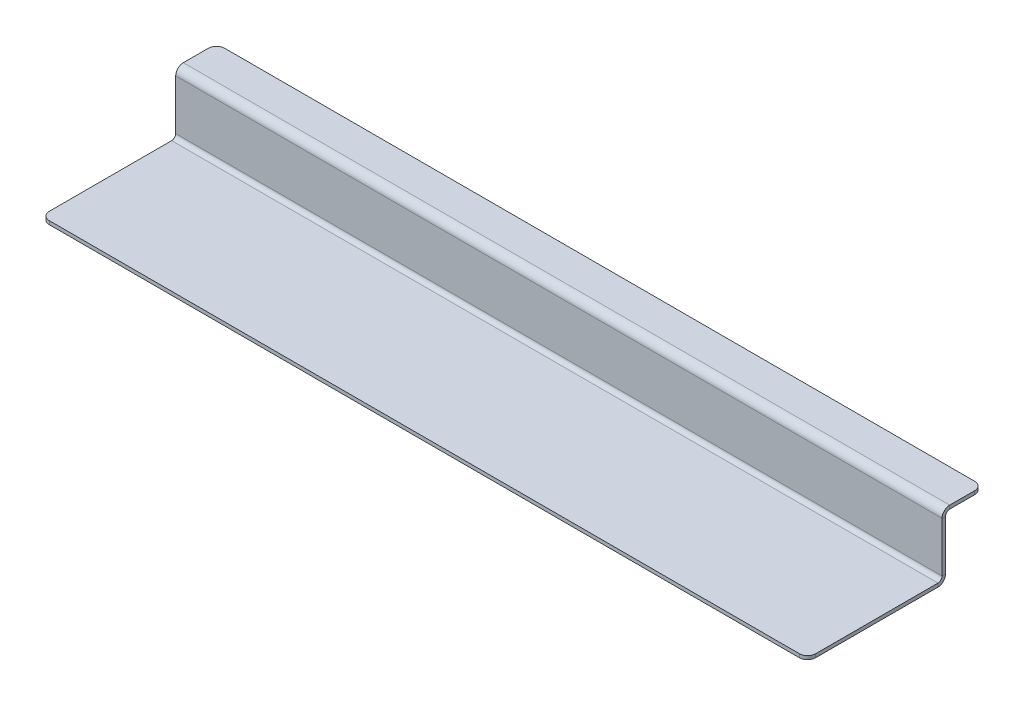
ISO-10303-21;
HEADER;
FILE_DESCRIPTION(('STEP AP214'),'2;1');
FILE_NAME('part.step','',(''),(''),'','','');
FILE_SCHEMA(('AUTOMOTIVE_DESIGN { 1 0 10303 214 1 1 1 1 }'));
ENDSEC;
DATA;
#1=APPLICATION_CONTEXT('core data for automotive mechanical design processes');
#2=APPLICATION_PROTOCOL_DEFINITION('international standard','automotive_design',2000,#1);
#3=PRODUCT_CONTEXT('',#1,'mechanical');
#4=PRODUCT('Part','Part','',(#3));
#5=PRODUCT_RELATED_PRODUCT_CATEGORY('part','',(#4));
#6=PRODUCT_DEFINITION_FORMATION('','',#4);
#7=PRODUCT_DEFINITION_CONTEXT('part definition',#1,'design');
#8=PRODUCT_DEFINITION('design','',#6,#7);
#9=PRODUCT_DEFINITION_SHAPE('','',#8);
#10=(LENGTH_UNIT() NAMED_UNIT(*) SI_UNIT(.MILLI.,.METRE.));
#11=(NAMED_UNIT(*) PLANE_ANGLE_UNIT() SI_UNIT($,.RADIAN.));
#12=(NAMED_UNIT(*) SI_UNIT($,.STERADIAN.) SOLID_ANGLE_UNIT());
#13=UNCERTAINTY_MEASURE_WITH_UNIT(LENGTH_MEASURE(1.E-05),#10,'distance_accuracy_value','');
#14=(GEOMETRIC_REPRESENTATION_CONTEXT(3) GLOBAL_UNCERTAINTY_ASSIGNED_CONTEXT((#13)) GLOBAL_UNIT_ASSIGNED_CONTEXT((#10,
#11,#12)) REPRESENTATION_CONTEXT('',''));
#15=CARTESIAN_POINT('',(0.,0.,0.));
#16=DIRECTION('',(0.,0.,1.));
#17=DIRECTION('',(1.,0.,0.));
#18=AXIS2_PLACEMENT_3D('',#15,#16,#17);
#19=CARTESIAN_POINT('',(596.9,-50.8,31.7500000000002));
#20=DIRECTION('',(-1.,0.,0.));
#21=DIRECTION('',(0.,0.,-1.));
#22=AXIS2_PLACEMENT_3D('',#19,#20,#21);
#23=PLANE('',#22);
#24=DIRECTION('',(0.,0.,-1.));
#25=VECTOR('',#24,1.);
#26=CARTESIAN_POINT('',(596.9,-44.87164,31.7500000000001));
#27=LINE('',#26,#25);
#28=CARTESIAN_POINT('',(596.9,-44.87164,31.7500000000001));
#29=VERTEX_POINT('',#28);
#30=CARTESIAN_POINT('',(596.9,-44.87164,28.9966400000001));
#31=VERTEX_POINT('',#30);
#32=EDGE_CURVE('E204',#29,#31,#27,.T.);
#33=ORIENTED_EDGE('',*,*,#32,.T.);
#34=DIRECTION('',(0.,1.,0.));
#35=VECTOR('',#34,1.);
#36=CARTESIAN_POINT('',(596.9,-50.8,28.9966400000002));
#37=LINE('',#36,#35);
#38=CARTESIAN_POINT('',(596.9,-5.92836000000005,28.99664));
#39=VERTEX_POINT('',#38);
#40=EDGE_CURVE('E219',#39,#31,#37,.F.);
#41=ORIENTED_EDGE('',*,*,#40,.F.);
#42=DIRECTION('',(0.,0.,-1.));
#43=VECTOR('',#42,1.);
#44=CARTESIAN_POINT('',(596.9,-5.92836000000001,28.99664));
#45=LINE('',#44,#43);
#46=CARTESIAN_POINT('',(596.9,-5.92835999999999,31.75));
#47=VERTEX_POINT('',#46);
#48=EDGE_CURVE('E225',#39,#47,#45,.F.);
#49=ORIENTED_EDGE('',*,*,#48,.T.);
#50=DIRECTION('',(0.,-1.,0.));
#51=VECTOR('',#50,1.);
#52=CARTESIAN_POINT('',(596.9,1.19661315799875E-13,31.75));
#53=LINE('',#52,#51);
#54=EDGE_CURVE('E213',#47,#29,#53,.T.);
#55=ORIENTED_EDGE('',*,*,#54,.T.);
#56=EDGE_LOOP('',(#33,#41,#49,#55));
#57=FACE_BOUND('',#56,.T.);
#58=ADVANCED_FACE('F43',(#57),#23,.F.);
#59=CARTESIAN_POINT('',(0.,-2.75335999999999,31.75));
#60=DIRECTION('',(1.,0.,0.));
#61=DIRECTION('',(0.,0.,1.));
#62=AXIS2_PLACEMENT_3D('',#59,#60,#61);
#63=PLANE('',#62);
#64=DIRECTION('',(0.,0.,-1.));
#65=VECTOR('',#64,1.);
#66=CARTESIAN_POINT('',(0.,-44.87164,31.7500000000001));
#67=LINE('',#66,#65);
#68=CARTESIAN_POINT('',(0.,-44.87164,31.7500000000001));
#69=VERTEX_POINT('',#68);
#70=CARTESIAN_POINT('',(0.,-44.87164,28.9966400000001));
#71=VERTEX_POINT('',#70);
#72=EDGE_CURVE('E190',#69,#71,#67,.T.);
#73=ORIENTED_EDGE('',*,*,#72,.F.);
#74=DIRECTION('',(0.,1.,0.));
#75=VECTOR('',#74,1.);
#76=CARTESIAN_POINT('',(0.,1.19661315799875E-13,31.75));
#77=LINE('',#76,#75);
#78=CARTESIAN_POINT('',(0.,-5.92835999999996,31.75));
#79=VERTEX_POINT('',#78);
#80=EDGE_CURVE('E209',#69,#79,#77,.T.);
#81=ORIENTED_EDGE('',*,*,#80,.T.);
#82=DIRECTION('',(0.,0.,-1.));
#83=VECTOR('',#82,1.);
#84=CARTESIAN_POINT('',(0.,-5.92835999999997,31.75));
#85=LINE('',#84,#83);
#86=CARTESIAN_POINT('',(0.,-5.92835999999997,28.99664));
#87=VERTEX_POINT('',#86);
#88=EDGE_CURVE('E207',#87,#79,#85,.F.);
#89=ORIENTED_EDGE('',*,*,#88,.F.);
#90=DIRECTION('',(0.,-1.,0.));
#91=VECTOR('',#90,1.);
#92=CARTESIAN_POINT('',(0.,-2.75336,28.99664));
#93=LINE('',#92,#91);
#94=EDGE_CURVE('E216',#71,#87,#93,.F.);
#95=ORIENTED_EDGE('',*,*,#94,.F.);
#96=EDGE_LOOP('',(#73,#81,#89,#95));
#97=FACE_BOUND('',#96,.T.);
#98=ADVANCED_FACE('F340',(#97),#63,.F.);
#99=CARTESIAN_POINT('',(0.,1.19661315799875E-13,31.75));
#100=DIRECTION('',(0.,0.,-1.));
#101=DIRECTION('',(0.,-1.,0.));
#102=AXIS2_PLACEMENT_3D('',#99,#100,#101);
#103=PLANE('',#102);
#104=DIRECTION('',(-1.,0.,0.));
#105=VECTOR('',#104,1.);
#106=CARTESIAN_POINT('',(0.,-44.87164,31.7500000000001));
#107=LINE('',#106,#105);
#108=EDGE_CURVE('E196',#69,#29,#107,.F.);
#109=ORIENTED_EDGE('',*,*,#108,.T.);
#110=ORIENTED_EDGE('',*,*,#54,.F.);
#111=DIRECTION('',(1.,0.,0.));
#112=VECTOR('',#111,1.);
#113=CARTESIAN_POINT('',(0.,-5.92835999999997,31.75));
#114=LINE('',#113,#112);
#115=EDGE_CURVE('E222',#47,#79,#114,.F.);
#116=ORIENTED_EDGE('',*,*,#115,.T.);
#117=ORIENTED_EDGE('',*,*,#80,.F.);
#118=EDGE_LOOP('',(#109,#110,#116,#117));
#119=FACE_BOUND('',#118,.T.);
#120=ADVANCED_FACE('F335',(#119),#103,.F.);
#121=CARTESIAN_POINT('',(0.,1.10048010740757E-13,28.99664));
#122=DIRECTION('',(0.,0.,-1.));
#123=DIRECTION('',(0.,-1.,0.));
#124=AXIS2_PLACEMENT_3D('',#121,#122,#123);
#125=PLANE('',#124);
#126=ORIENTED_EDGE('',*,*,#94,.T.);
#127=DIRECTION('',(1.,0.,0.));
#128=VECTOR('',#127,1.);
#129=CARTESIAN_POINT('',(0.,-5.92835999999999,28.99664));
#130=LINE('',#129,#128);
#131=EDGE_CURVE('E228',#87,#39,#130,.T.);
#132=ORIENTED_EDGE('',*,*,#131,.T.);
#133=ORIENTED_EDGE('',*,*,#40,.T.);
#134=DIRECTION('',(-1.,0.,0.));
#135=VECTOR('',#134,1.);
#136=CARTESIAN_POINT('',(0.,-44.87164,28.9966400000001));
#137=LINE('',#136,#135);
#138=EDGE_CURVE('E191',#71,#31,#137,.F.);
#139=ORIENTED_EDGE('',*,*,#138,.F.);
#140=EDGE_LOOP('',(#126,#132,#133,#139));
#141=FACE_BOUND('',#140,.T.);
#142=ADVANCED_FACE('F342',(#141),#125,.T.);
#143=CARTESIAN_POINT('',(596.9,-2.75336,0.));
#144=DIRECTION('',(1.,0.,0.));
#145=DIRECTION('',(0.,0.,1.));
#146=AXIS2_PLACEMENT_3D('',#143,#144,#145);
#147=PLANE('',#146);
#148=DIRECTION('',(0.,0.,1.));
#149=VECTOR('',#148,1.);
#150=CARTESIAN_POINT('',(596.9,0.,0.));
#151=LINE('',#150,#149);
#152=CARTESIAN_POINT('',(596.9,0.,6.35));
#153=VERTEX_POINT('',#152);
#154=CARTESIAN_POINT('',(596.9,0.,25.82164));
#155=VERTEX_POINT('',#154);
#156=EDGE_CURVE('E257',#153,#155,#151,.T.);
#157=ORIENTED_EDGE('',*,*,#156,.T.);
#158=DIRECTION('',(0.,1.,0.));
#159=VECTOR('',#158,1.);
#160=CARTESIAN_POINT('',(596.9,-2.75336000000006,25.82164));
#161=LINE('',#160,#159);
#162=CARTESIAN_POINT('',(596.9,-2.75336,25.82164));
#163=VERTEX_POINT('',#162);
#164=EDGE_CURVE('E239',#163,#155,#161,.T.);
#165=ORIENTED_EDGE('',*,*,#164,.F.);
#166=DIRECTION('',(0.,0.,1.));
#167=VECTOR('',#166,1.);
#168=CARTESIAN_POINT('',(596.9,-2.75336,0.));
#169=LINE('',#168,#167);
#170=CARTESIAN_POINT('',(596.9,-2.75336,6.35));
#171=VERTEX_POINT('',#170);
#172=EDGE_CURVE('E260',#171,#163,#169,.T.);
#173=ORIENTED_EDGE('',*,*,#172,.F.);
#174=DIRECTION('',(0.,1.,0.));
#175=VECTOR('',#174,1.);
#176=CARTESIAN_POINT('',(596.9,-2.75336,6.35));
#177=LINE('',#176,#175);
#178=EDGE_CURVE('E279',#153,#171,#177,.F.);
#179=ORIENTED_EDGE('',*,*,#178,.F.);
#180=EDGE_LOOP('',(#157,#165,#173,#179));
#181=FACE_BOUND('',#180,.T.);
#182=ADVANCED_FACE('F386',(#181),#147,.T.);
#183=CARTESIAN_POINT('',(0.,-2.75336,0.));
#184=DIRECTION('',(0.,-1.,0.));
#185=DIRECTION('',(0.,0.,1.));
#186=AXIS2_PLACEMENT_3D('',#183,#184,#185);
#187=PLANE('',#186);
#188=ORIENTED_EDGE('',*,*,#172,.T.);
#189=DIRECTION('',(1.,0.,0.));
#190=VECTOR('',#189,1.);
#191=CARTESIAN_POINT('',(596.9,-2.75336000000006,25.82164));
#192=LINE('',#191,#190);
#193=CARTESIAN_POINT('',(0.,-2.75336,25.82164));
#194=VERTEX_POINT('',#193);
#195=EDGE_CURVE('E243',#163,#194,#192,.F.);
#196=ORIENTED_EDGE('',*,*,#195,.T.);
#197=DIRECTION('',(0.,0.,-1.));
#198=VECTOR('',#197,1.);
#199=CARTESIAN_POINT('',(0.,-2.75336,0.));
#200=LINE('',#199,#198);
#201=CARTESIAN_POINT('',(0.,-2.75336,6.35));
#202=VERTEX_POINT('',#201);
#203=EDGE_CURVE('E253',#194,#202,#200,.T.);
#204=ORIENTED_EDGE('',*,*,#203,.T.);
#205=CARTESIAN_POINT('',(6.35,-2.75336,6.35));
#206=DIRECTION('',(0.,1.,0.));
#207=DIRECTION('',(0.,0.,1.));
#208=AXIS2_PLACEMENT_3D('',#205,#206,#207);
#209=CIRCLE('',#208,6.35);
#210=CARTESIAN_POINT('',(6.35,-2.75336,0.));
#211=VERTEX_POINT('',#210);
#212=EDGE_CURVE('E282',#211,#202,#209,.T.);
#213=ORIENTED_EDGE('',*,*,#212,.F.);
#214=DIRECTION('',(1.,0.,0.));
#215=VECTOR('',#214,1.);
#216=CARTESIAN_POINT('',(0.,-2.75336,0.));
#217=LINE('',#216,#215);
#218=CARTESIAN_POINT('',(590.55,-2.75336,0.));
#219=VERTEX_POINT('',#218);
#220=EDGE_CURVE('E256',#211,#219,#217,.T.);
#221=ORIENTED_EDGE('',*,*,#220,.T.);
#222=CARTESIAN_POINT('',(590.55,-2.75336,6.35));
#223=DIRECTION('',(0.,1.,0.));
#224=DIRECTION('',(0.,0.,1.));
#225=AXIS2_PLACEMENT_3D('',#222,#223,#224);
#226=CIRCLE('',#225,6.35);
#227=EDGE_CURVE('E285',#171,#219,#226,.T.);
#228=ORIENTED_EDGE('',*,*,#227,.F.);
#229=EDGE_LOOP('',(#188,#196,#204,#213,#221,#228));
#230=FACE_BOUND('',#229,.T.);
#231=ADVANCED_FACE('F364',(#230),#187,.T.);
#232=CARTESIAN_POINT('',(0.,0.,0.));
#233=DIRECTION('',(0.,-1.,0.));
#234=DIRECTION('',(0.,0.,1.));
#235=AXIS2_PLACEMENT_3D('',#232,#233,#234);
#236=PLANE('',#235);
#237=DIRECTION('',(1.,0.,0.));
#238=VECTOR('',#237,1.);
#239=CARTESIAN_POINT('',(0.,0.,0.));
#240=LINE('',#239,#238);
#241=CARTESIAN_POINT('',(6.35,0.,0.));
#242=VERTEX_POINT('',#241);
#243=CARTESIAN_POINT('',(590.55,0.,0.));
#244=VERTEX_POINT('',#243);
#245=EDGE_CURVE('E266',#242,#244,#240,.T.);
#246=ORIENTED_EDGE('',*,*,#245,.F.);
#247=CARTESIAN_POINT('',(6.35,0.,6.35));
#248=DIRECTION('',(0.,1.,0.));
#249=DIRECTION('',(0.,0.,1.));
#250=AXIS2_PLACEMENT_3D('',#247,#248,#249);
#251=CIRCLE('',#250,6.35);
#252=CARTESIAN_POINT('',(0.,0.,6.35));
#253=VERTEX_POINT('',#252);
#254=EDGE_CURVE('E274',#253,#242,#251,.F.);
#255=ORIENTED_EDGE('',*,*,#254,.F.);
#256=DIRECTION('',(0.,0.,-1.));
#257=VECTOR('',#256,1.);
#258=CARTESIAN_POINT('',(0.,0.,0.));
#259=LINE('',#258,#257);
#260=CARTESIAN_POINT('',(0.,0.,25.82164));
#261=VERTEX_POINT('',#260);
#262=EDGE_CURVE('E250',#261,#253,#259,.T.);
#263=ORIENTED_EDGE('',*,*,#262,.F.);
#264=DIRECTION('',(1.,0.,0.));
#265=VECTOR('',#264,1.);
#266=CARTESIAN_POINT('',(596.9,0.,25.82164));
#267=LINE('',#266,#265);
#268=EDGE_CURVE('E233',#155,#261,#267,.F.);
#269=ORIENTED_EDGE('',*,*,#268,.F.);
#270=ORIENTED_EDGE('',*,*,#156,.F.);
#271=CARTESIAN_POINT('',(590.55,0.,6.35));
#272=DIRECTION('',(0.,1.,0.));
#273=DIRECTION('',(0.,0.,1.));
#274=AXIS2_PLACEMENT_3D('',#271,#272,#273);
#275=CIRCLE('',#274,6.35);
#276=EDGE_CURVE('E277',#244,#153,#275,.F.);
#277=ORIENTED_EDGE('',*,*,#276,.F.);
#278=EDGE_LOOP('',(#246,#255,#263,#269,#270,#277));
#279=FACE_BOUND('',#278,.T.);
#280=ADVANCED_FACE('F458',(#279),#236,.F.);
#281=CARTESIAN_POINT('',(0.,-2.75336,0.));
#282=DIRECTION('',(-1.,0.,0.));
#283=DIRECTION('',(0.,0.,-1.));
#284=AXIS2_PLACEMENT_3D('',#281,#282,#283);
#285=PLANE('',#284);
#286=ORIENTED_EDGE('',*,*,#203,.F.);
#287=DIRECTION('',(0.,1.,0.));
#288=VECTOR('',#287,1.);
#289=CARTESIAN_POINT('',(0.,-2.75335999999998,25.82164));
#290=LINE('',#289,#288);
#291=EDGE_CURVE('E247',#194,#261,#290,.T.);
#292=ORIENTED_EDGE('',*,*,#291,.T.);
#293=ORIENTED_EDGE('',*,*,#262,.T.);
#294=DIRECTION('',(0.,1.,0.));
#295=VECTOR('',#294,1.);
#296=CARTESIAN_POINT('',(0.,-2.75336,6.35));
#297=LINE('',#296,#295);
#298=EDGE_CURVE('E11',#202,#253,#297,.T.);
#299=ORIENTED_EDGE('',*,*,#298,.F.);
#300=EDGE_LOOP('',(#286,#292,#293,#299));
#301=FACE_BOUND('',#300,.T.);
#302=ADVANCED_FACE('F360',(#301),#285,.T.);
#303=CARTESIAN_POINT('',(0.,-2.75336,0.));
#304=DIRECTION('',(0.,0.,-1.));
#305=DIRECTION('',(1.,0.,0.));
#306=AXIS2_PLACEMENT_3D('',#303,#304,#305);
#307=PLANE('',#306);
#308=ORIENTED_EDGE('',*,*,#220,.F.);
#309=DIRECTION('',(0.,1.,0.));
#310=VECTOR('',#309,1.);
#311=CARTESIAN_POINT('',(6.35,-2.75336,0.));
#312=LINE('',#311,#310);
#313=EDGE_CURVE('E263',#242,#211,#312,.F.);
#314=ORIENTED_EDGE('',*,*,#313,.F.);
#315=ORIENTED_EDGE('',*,*,#245,.T.);
#316=DIRECTION('',(0.,1.,0.));
#317=VECTOR('',#316,1.);
#318=CARTESIAN_POINT('',(590.55,-2.75336,0.));
#319=LINE('',#318,#317);
#320=EDGE_CURVE('E272',#219,#244,#319,.T.);
#321=ORIENTED_EDGE('',*,*,#320,.F.);
#322=EDGE_LOOP('',(#308,#314,#315,#321));
#323=FACE_BOUND('',#322,.T.);
#324=ADVANCED_FACE('F457',(#323),#307,.T.);
#325=CARTESIAN_POINT('',(0.,-5.92835999999998,25.82164));
#326=DIRECTION('',(-1.,0.,0.));
#327=DIRECTION('',(0.,-1.,0.));
#328=AXIS2_PLACEMENT_3D('',#325,#326,#327);
#329=PLANE('',#328);
#330=ORIENTED_EDGE('',*,*,#88,.T.);
#331=CARTESIAN_POINT('',(0.,-5.92835999999998,25.82164));
#332=DIRECTION('',(-1.,0.,0.));
#333=DIRECTION('',(0.,1.,0.));
#334=AXIS2_PLACEMENT_3D('',#331,#332,#333);
#335=CIRCLE('',#334,5.92836);
#336=EDGE_CURVE('E236',#261,#79,#335,.F.);
#337=ORIENTED_EDGE('',*,*,#336,.F.);
#338=ORIENTED_EDGE('',*,*,#291,.F.);
#339=CARTESIAN_POINT('',(0.,-5.92835999999998,25.82164));
#340=DIRECTION('',(-1.,0.,0.));
#341=DIRECTION('',(0.,1.,0.));
#342=AXIS2_PLACEMENT_3D('',#339,#340,#341);
#343=CIRCLE('',#342,3.175);
#344=EDGE_CURVE('E241',#194,#87,#343,.F.);
#345=ORIENTED_EDGE('',*,*,#344,.T.);
#346=EDGE_LOOP('',(#330,#337,#338,#345));
#347=FACE_BOUND('',#346,.T.);
#348=ADVANCED_FACE('F357',(#347),#329,.T.);
#349=CARTESIAN_POINT('',(596.9,-5.92836000000006,25.82164));
#350=DIRECTION('',(-1.,0.,0.));
#351=DIRECTION('',(0.,-1.,0.));
#352=AXIS2_PLACEMENT_3D('',#349,#350,#351);
#353=PLANE('',#352);
#354=CARTESIAN_POINT('',(596.9,-5.92836000000006,25.82164));
#355=DIRECTION('',(-1.,0.,0.));
#356=DIRECTION('',(0.,1.,0.));
#357=AXIS2_PLACEMENT_3D('',#354,#355,#356);
#358=CIRCLE('',#357,3.175);
#359=EDGE_CURVE('E212',#39,#163,#358,.T.);
#360=ORIENTED_EDGE('',*,*,#359,.T.);
#361=ORIENTED_EDGE('',*,*,#164,.T.);
#362=CARTESIAN_POINT('',(596.9,-5.92836000000006,25.82164));
#363=DIRECTION('',(-1.,0.,0.));
#364=DIRECTION('',(0.,1.,0.));
#365=AXIS2_PLACEMENT_3D('',#362,#363,#364);
#366=CIRCLE('',#365,5.92836);
#367=EDGE_CURVE('E237',#47,#155,#366,.T.);
#368=ORIENTED_EDGE('',*,*,#367,.F.);
#369=ORIENTED_EDGE('',*,*,#48,.F.);
#370=EDGE_LOOP('',(#360,#361,#368,#369));
#371=FACE_BOUND('',#370,.T.);
#372=ADVANCED_FACE('F348',(#371),#353,.F.);
#373=CARTESIAN_POINT('',(596.9,-5.92836000000006,25.82164));
#374=DIRECTION('',(1.,0.,0.));
#375=DIRECTION('',(0.,0.,1.));
#376=AXIS2_PLACEMENT_3D('',#373,#374,#375);
#377=CYLINDRICAL_SURFACE('',#376,5.92836);
#378=ORIENTED_EDGE('',*,*,#268,.T.);
#379=ORIENTED_EDGE('',*,*,#336,.T.);
#380=ORIENTED_EDGE('',*,*,#115,.F.);
#381=ORIENTED_EDGE('',*,*,#367,.T.);
#382=EDGE_LOOP('',(#378,#379,#380,#381));
#383=FACE_BOUND('',#382,.T.);
#384=ADVANCED_FACE('F353',(#383),#377,.T.);
#385=CARTESIAN_POINT('',(596.9,-5.92836000000006,25.82164));
#386=DIRECTION('',(1.,0.,0.));
#387=DIRECTION('',(0.,0.,1.));
#388=AXIS2_PLACEMENT_3D('',#385,#386,#387);
#389=CYLINDRICAL_SURFACE('',#388,3.175);
#390=ORIENTED_EDGE('',*,*,#195,.F.);
#391=ORIENTED_EDGE('',*,*,#359,.F.);
#392=ORIENTED_EDGE('',*,*,#131,.F.);
#393=ORIENTED_EDGE('',*,*,#344,.F.);
#394=EDGE_LOOP('',(#390,#391,#392,#393));
#395=FACE_BOUND('',#394,.T.);
#396=ADVANCED_FACE('F367',(#395),#389,.F.);
#397=CARTESIAN_POINT('',(596.9,-44.87164,34.9250000000002));
#398=DIRECTION('',(1.,0.,0.));
#399=DIRECTION('',(0.,0.,1.));
#400=AXIS2_PLACEMENT_3D('',#397,#398,#399);
#401=PLANE('',#400);
#402=DIRECTION('',(0.,1.,0.));
#403=VECTOR('',#402,1.);
#404=CARTESIAN_POINT('',(596.9,-50.8,34.9250000000002));
#405=LINE('',#404,#403);
#406=CARTESIAN_POINT('',(596.9,-48.04664,34.9250000000002));
#407=VERTEX_POINT('',#406);
#408=CARTESIAN_POINT('',(596.9,-50.8,34.9250000000002));
#409=VERTEX_POINT('',#408);
#410=EDGE_CURVE('E314',#407,#409,#405,.F.);
#411=ORIENTED_EDGE('',*,*,#410,.T.);
#412=CARTESIAN_POINT('',(596.9,-44.87164,34.9250000000002));
#413=DIRECTION('',(1.,0.,0.));
#414=DIRECTION('',(0.,0.,-1.));
#415=AXIS2_PLACEMENT_3D('',#412,#413,#414);
#416=CIRCLE('',#415,5.92836);
#417=EDGE_CURVE('E173',#31,#409,#416,.F.);
#418=ORIENTED_EDGE('',*,*,#417,.F.);
#419=ORIENTED_EDGE('',*,*,#32,.F.);
#420=CARTESIAN_POINT('',(596.9,-44.87164,34.9250000000002));
#421=DIRECTION('',(1.,0.,0.));
#422=DIRECTION('',(0.,0.,-1.));
#423=AXIS2_PLACEMENT_3D('',#420,#421,#422);
#424=CIRCLE('',#423,3.175);
#425=EDGE_CURVE('E192',#29,#407,#424,.F.);
#426=ORIENTED_EDGE('',*,*,#425,.T.);
#427=EDGE_LOOP('',(#411,#418,#419,#426));
#428=FACE_BOUND('',#427,.T.);
#429=ADVANCED_FACE('F317',(#428),#401,.T.);
#430=CARTESIAN_POINT('',(0.,-44.87164,34.9250000000002));
#431=DIRECTION('',(1.,0.,0.));
#432=DIRECTION('',(0.,0.,1.));
#433=AXIS2_PLACEMENT_3D('',#430,#431,#432);
#434=PLANE('',#433);
#435=CARTESIAN_POINT('',(0.,-44.87164,34.9250000000002));
#436=DIRECTION('',(1.,0.,0.));
#437=DIRECTION('',(0.,0.,-1.));
#438=AXIS2_PLACEMENT_3D('',#435,#436,#437);
#439=CIRCLE('',#438,3.175);
#440=CARTESIAN_POINT('',(0.,-48.04664,34.9250000000002));
#441=VERTEX_POINT('',#440);
#442=EDGE_CURVE('E202',#441,#69,#439,.T.);
#443=ORIENTED_EDGE('',*,*,#442,.T.);
#444=ORIENTED_EDGE('',*,*,#72,.T.);
#445=CARTESIAN_POINT('',(0.,-44.87164,34.9250000000002));
#446=DIRECTION('',(1.,0.,0.));
#447=DIRECTION('',(0.,0.,-1.));
#448=AXIS2_PLACEMENT_3D('',#445,#446,#447);
#449=CIRCLE('',#448,5.92836);
#450=CARTESIAN_POINT('',(0.,-50.8,34.9250000000001));
#451=VERTEX_POINT('',#450);
#452=EDGE_CURVE('E171',#451,#71,#449,.T.);
#453=ORIENTED_EDGE('',*,*,#452,.F.);
#454=DIRECTION('',(0.,1.,0.));
#455=VECTOR('',#454,1.);
#456=CARTESIAN_POINT('',(0.,-48.04664,34.9250000000001));
#457=LINE('',#456,#455);
#458=EDGE_CURVE('E176',#441,#451,#457,.F.);
#459=ORIENTED_EDGE('',*,*,#458,.F.);
#460=EDGE_LOOP('',(#443,#444,#453,#459));
#461=FACE_BOUND('',#460,.T.);
#462=ADVANCED_FACE('F188',(#461),#434,.F.);
#463=CARTESIAN_POINT('',(0.,-44.87164,34.9250000000002));
#464=DIRECTION('',(-1.,0.,0.));
#465=DIRECTION('',(0.,-1.,0.));
#466=AXIS2_PLACEMENT_3D('',#463,#464,#465);
#467=CYLINDRICAL_SURFACE('',#466,5.92836);
#468=ORIENTED_EDGE('',*,*,#138,.T.);
#469=ORIENTED_EDGE('',*,*,#417,.T.);
#470=DIRECTION('',(-1.,0.,0.));
#471=VECTOR('',#470,1.);
#472=CARTESIAN_POINT('',(596.9,-50.8,34.9250000000002));
#473=LINE('',#472,#471);
#474=EDGE_CURVE('E159',#451,#409,#473,.F.);
#475=ORIENTED_EDGE('',*,*,#474,.F.);
#476=ORIENTED_EDGE('',*,*,#452,.T.);
#477=EDGE_LOOP('',(#468,#469,#475,#476));
#478=FACE_BOUND('',#477,.T.);
#479=ADVANCED_FACE('F169',(#478),#467,.T.);
#480=CARTESIAN_POINT('',(0.,-44.87164,34.9250000000002));
#481=DIRECTION('',(-1.,0.,0.));
#482=DIRECTION('',(0.,-1.,0.));
#483=AXIS2_PLACEMENT_3D('',#480,#481,#482);
#484=CYLINDRICAL_SURFACE('',#483,3.175);
#485=ORIENTED_EDGE('',*,*,#108,.F.);
#486=ORIENTED_EDGE('',*,*,#442,.F.);
#487=DIRECTION('',(-1.,0.,0.));
#488=VECTOR('',#487,1.);
#489=CARTESIAN_POINT('',(596.9,-48.04664,34.9250000000002));
#490=LINE('',#489,#488);
#491=EDGE_CURVE('E185',#407,#441,#490,.T.);
#492=ORIENTED_EDGE('',*,*,#491,.F.);
#493=ORIENTED_EDGE('',*,*,#425,.F.);
#494=EDGE_LOOP('',(#485,#486,#492,#493));
#495=FACE_BOUND('',#494,.T.);
#496=ADVANCED_FACE('F331',(#495),#484,.F.);
#497=CARTESIAN_POINT('',(596.9,-50.8,31.7500000000002));
#498=DIRECTION('',(-1.,0.,0.));
#499=DIRECTION('',(0.,0.,-1.));
#500=AXIS2_PLACEMENT_3D('',#497,#498,#499);
#501=PLANE('',#500);
#502=DIRECTION('',(0.,0.,-1.));
#503=VECTOR('',#502,1.);
#504=CARTESIAN_POINT('',(596.9,-50.8,0.));
#505=LINE('',#504,#503);
#506=CARTESIAN_POINT('',(596.9,-50.8,130.175));
#507=VERTEX_POINT('',#506);
#508=EDGE_CURVE('E165',#507,#409,#505,.T.);
#509=ORIENTED_EDGE('',*,*,#508,.T.);
#510=ORIENTED_EDGE('',*,*,#410,.F.);
#511=DIRECTION('',(0.,0.,1.));
#512=VECTOR('',#511,1.);
#513=CARTESIAN_POINT('',(596.9,-48.04664,31.7500000000002));
#514=LINE('',#513,#512);
#515=CARTESIAN_POINT('',(596.9,-48.04664,130.175));
#516=VERTEX_POINT('',#515);
#517=EDGE_CURVE('E175',#516,#407,#514,.F.);
#518=ORIENTED_EDGE('',*,*,#517,.F.);
#519=DIRECTION('',(0.,1.,0.));
#520=VECTOR('',#519,1.);
#521=CARTESIAN_POINT('',(596.9,-50.8,130.175));
#522=LINE('',#521,#520);
#523=EDGE_CURVE('E288',#507,#516,#522,.T.);
#524=ORIENTED_EDGE('',*,*,#523,.F.);
#525=EDGE_LOOP('',(#509,#510,#518,#524));
#526=FACE_BOUND('',#525,.T.);
#527=ADVANCED_FACE('F321',(#526),#501,.F.);
#528=CARTESIAN_POINT('',(0.,-50.8,136.525));
#529=DIRECTION('',(1.,0.,0.));
#530=DIRECTION('',(0.,0.,1.));
#531=AXIS2_PLACEMENT_3D('',#528,#529,#530);
#532=PLANE('',#531);
#533=DIRECTION('',(0.,0.,-1.));
#534=VECTOR('',#533,1.);
#535=CARTESIAN_POINT('',(0.,-48.04664,136.525));
#536=LINE('',#535,#534);
#537=CARTESIAN_POINT('',(0.,-48.04664,130.175));
#538=VERTEX_POINT('',#537);
#539=EDGE_CURVE('E181',#441,#538,#536,.F.);
#540=ORIENTED_EDGE('',*,*,#539,.F.);
#541=ORIENTED_EDGE('',*,*,#458,.T.);
#542=DIRECTION('',(0.,0.,1.));
#543=VECTOR('',#542,1.);
#544=CARTESIAN_POINT('',(0.,-50.8,0.));
#545=LINE('',#544,#543);
#546=CARTESIAN_POINT('',(0.,-50.8,130.175));
#547=VERTEX_POINT('',#546);
#548=EDGE_CURVE('E155',#451,#547,#545,.T.);
#549=ORIENTED_EDGE('',*,*,#548,.T.);
#550=DIRECTION('',(0.,1.,0.));
#551=VECTOR('',#550,1.);
#552=CARTESIAN_POINT('',(0.,-50.8,130.175));
#553=LINE('',#552,#551);
#554=EDGE_CURVE('E51',#538,#547,#553,.F.);
#555=ORIENTED_EDGE('',*,*,#554,.F.);
#556=EDGE_LOOP('',(#540,#541,#549,#555));
#557=FACE_BOUND('',#556,.T.);
#558=ADVANCED_FACE('F179',(#557),#532,.F.);
#559=CARTESIAN_POINT('',(0.,-50.8,0.));
#560=DIRECTION('',(0.,1.,0.));
#561=DIRECTION('',(0.,0.,-1.));
#562=AXIS2_PLACEMENT_3D('',#559,#560,#561);
#563=PLANE('',#562);
#564=DIRECTION('',(1.,0.,0.));
#565=VECTOR('',#564,1.);
#566=CARTESIAN_POINT('',(0.,-50.8,136.525));
#567=LINE('',#566,#565);
#568=CARTESIAN_POINT('',(6.34999999999997,-50.8,136.525));
#569=VERTEX_POINT('',#568);
#570=CARTESIAN_POINT('',(590.55,-50.8,136.525));
#571=VERTEX_POINT('',#570);
#572=EDGE_CURVE('E164',#569,#571,#567,.T.);
#573=ORIENTED_EDGE('',*,*,#572,.F.);
#574=CARTESIAN_POINT('',(6.34999999999997,-50.8,130.175));
#575=DIRECTION('',(0.,-1.,0.));
#576=DIRECTION('',(0.,0.,-1.));
#577=AXIS2_PLACEMENT_3D('',#574,#575,#576);
#578=CIRCLE('',#577,6.35);
#579=EDGE_CURVE('E58',#547,#569,#578,.F.);
#580=ORIENTED_EDGE('',*,*,#579,.F.);
#581=ORIENTED_EDGE('',*,*,#548,.F.);
#582=ORIENTED_EDGE('',*,*,#474,.T.);
#583=ORIENTED_EDGE('',*,*,#508,.F.);
#584=CARTESIAN_POINT('',(590.55,-50.8,130.175));
#585=DIRECTION('',(0.,-1.,0.));
#586=DIRECTION('',(0.,0.,-1.));
#587=AXIS2_PLACEMENT_3D('',#584,#585,#586);
#588=CIRCLE('',#587,6.35);
#589=EDGE_CURVE('E299',#571,#507,#588,.F.);
#590=ORIENTED_EDGE('',*,*,#589,.F.);
#591=EDGE_LOOP('',(#573,#580,#581,#582,#583,#590));
#592=FACE_BOUND('',#591,.T.);
#593=ADVANCED_FACE('F157',(#592),#563,.F.);
#594=CARTESIAN_POINT('',(0.,-48.04664,0.));
#595=DIRECTION('',(0.,1.,0.));
#596=DIRECTION('',(0.,0.,-1.));
#597=AXIS2_PLACEMENT_3D('',#594,#595,#596);
#598=PLANE('',#597);
#599=ORIENTED_EDGE('',*,*,#517,.T.);
#600=ORIENTED_EDGE('',*,*,#491,.T.);
#601=ORIENTED_EDGE('',*,*,#539,.T.);
#602=CARTESIAN_POINT('',(6.34999999999997,-48.04664,130.175));
#603=DIRECTION('',(0.,-1.,0.));
#604=DIRECTION('',(0.,0.,-1.));
#605=AXIS2_PLACEMENT_3D('',#602,#603,#604);
#606=CIRCLE('',#605,6.35);
#607=CARTESIAN_POINT('',(6.34999999999997,-48.04664,136.525));
#608=VERTEX_POINT('',#607);
#609=EDGE_CURVE('E291',#608,#538,#606,.T.);
#610=ORIENTED_EDGE('',*,*,#609,.F.);
#611=DIRECTION('',(-1.,0.,0.));
#612=VECTOR('',#611,1.);
#613=CARTESIAN_POINT('',(596.9,-48.04664,136.525));
#614=LINE('',#613,#612);
#615=CARTESIAN_POINT('',(590.55,-48.04664,136.525));
#616=VERTEX_POINT('',#615);
#617=EDGE_CURVE('E307',#608,#616,#614,.F.);
#618=ORIENTED_EDGE('',*,*,#617,.T.);
#619=CARTESIAN_POINT('',(590.55,-48.04664,130.175));
#620=DIRECTION('',(0.,-1.,0.));
#621=DIRECTION('',(0.,0.,-1.));
#622=AXIS2_PLACEMENT_3D('',#619,#620,#621);
#623=CIRCLE('',#622,6.35);
#624=EDGE_CURVE('E293',#516,#616,#623,.T.);
#625=ORIENTED_EDGE('',*,*,#624,.F.);
#626=EDGE_LOOP('',(#599,#600,#601,#610,#618,#625));
#627=FACE_BOUND('',#626,.T.);
#628=ADVANCED_FACE('F304',(#627),#598,.T.);
#629=CARTESIAN_POINT('',(596.9,-50.8,136.525));
#630=DIRECTION('',(0.,0.,-1.));
#631=DIRECTION('',(0.,-1.,0.));
#632=AXIS2_PLACEMENT_3D('',#629,#630,#631);
#633=PLANE('',#632);
#634=ORIENTED_EDGE('',*,*,#617,.F.);
#635=DIRECTION('',(0.,1.,0.));
#636=VECTOR('',#635,1.);
#637=CARTESIAN_POINT('',(6.34999999999997,-50.8,136.525));
#638=LINE('',#637,#636);
#639=EDGE_CURVE('E295',#569,#608,#638,.T.);
#640=ORIENTED_EDGE('',*,*,#639,.F.);
#641=ORIENTED_EDGE('',*,*,#572,.T.);
#642=DIRECTION('',(0.,1.,0.));
#643=VECTOR('',#642,1.);
#644=CARTESIAN_POINT('',(590.55,-50.8,136.525));
#645=LINE('',#644,#643);
#646=EDGE_CURVE('E66',#616,#571,#645,.F.);
#647=ORIENTED_EDGE('',*,*,#646,.F.);
#648=EDGE_LOOP('',(#634,#640,#641,#647));
#649=FACE_BOUND('',#648,.T.);
#650=ADVANCED_FACE('F327',(#649),#633,.F.);
#651=CARTESIAN_POINT('',(590.55,-2.75336,6.35));
#652=DIRECTION('',(0.,1.,0.));
#653=DIRECTION('',(0.,0.,-1.));
#654=AXIS2_PLACEMENT_3D('',#651,#652,#653);
#655=CYLINDRICAL_SURFACE('',#654,6.35);
#656=ORIENTED_EDGE('',*,*,#227,.T.);
#657=ORIENTED_EDGE('',*,*,#320,.T.);
#658=ORIENTED_EDGE('',*,*,#276,.T.);
#659=ORIENTED_EDGE('',*,*,#178,.T.);
#660=EDGE_LOOP('',(#656,#657,#658,#659));
#661=FACE_BOUND('',#660,.T.);
#662=ADVANCED_FACE('F401',(#661),#655,.T.);
#663=CARTESIAN_POINT('',(590.55,-50.8,130.175));
#664=DIRECTION('',(0.,1.,0.));
#665=DIRECTION('',(0.,0.,-1.));
#666=AXIS2_PLACEMENT_3D('',#663,#664,#665);
#667=CYLINDRICAL_SURFACE('',#666,6.35);
#668=ORIENTED_EDGE('',*,*,#589,.T.);
#669=ORIENTED_EDGE('',*,*,#523,.T.);
#670=ORIENTED_EDGE('',*,*,#624,.T.);
#671=ORIENTED_EDGE('',*,*,#646,.T.);
#672=EDGE_LOOP('',(#668,#669,#670,#671));
#673=FACE_BOUND('',#672,.T.);
#674=ADVANCED_FACE('F328',(#673),#667,.T.);
#675=CARTESIAN_POINT('',(6.34999999999997,-50.8,130.175));
#676=DIRECTION('',(0.,1.,0.));
#677=DIRECTION('',(0.,0.,-1.));
#678=AXIS2_PLACEMENT_3D('',#675,#676,#677);
#679=CYLINDRICAL_SURFACE('',#678,6.35);
#680=ORIENTED_EDGE('',*,*,#579,.T.);
#681=ORIENTED_EDGE('',*,*,#639,.T.);
#682=ORIENTED_EDGE('',*,*,#609,.T.);
#683=ORIENTED_EDGE('',*,*,#554,.T.);
#684=EDGE_LOOP('',(#680,#681,#682,#683));
#685=FACE_BOUND('',#684,.T.);
#686=ADVANCED_FACE('F301',(#685),#679,.T.);
#687=CARTESIAN_POINT('',(6.35,-2.75336,6.35));
#688=DIRECTION('',(0.,1.,0.));
#689=DIRECTION('',(0.,0.,-1.));
#690=AXIS2_PLACEMENT_3D('',#687,#688,#689);
#691=CYLINDRICAL_SURFACE('',#690,6.35);
#692=ORIENTED_EDGE('',*,*,#212,.T.);
#693=ORIENTED_EDGE('',*,*,#298,.T.);
#694=ORIENTED_EDGE('',*,*,#254,.T.);
#695=ORIENTED_EDGE('',*,*,#313,.T.);
#696=EDGE_LOOP('',(#692,#693,#694,#695));
#697=FACE_BOUND('',#696,.T.);
#698=ADVANCED_FACE('F45',(#697),#691,.T.);
#699=CLOSED_SHELL('',(#58,#98,#120,#142,#182,#231,#280,#302,#324,#348,#372,#384,#396,#429,#462,
#479,#496,#527,#558,#593,#628,#650,#662,#674,#686,#698));
#700=MANIFOLD_SOLID_BREP('B2',#699);
#701=ADVANCED_BREP_SHAPE_REPRESENTATION('',(#18,#700),#14);
#702=SHAPE_DEFINITION_REPRESENTATION(#9,#701);
ENDSEC;
END-ISO-10303-21;
